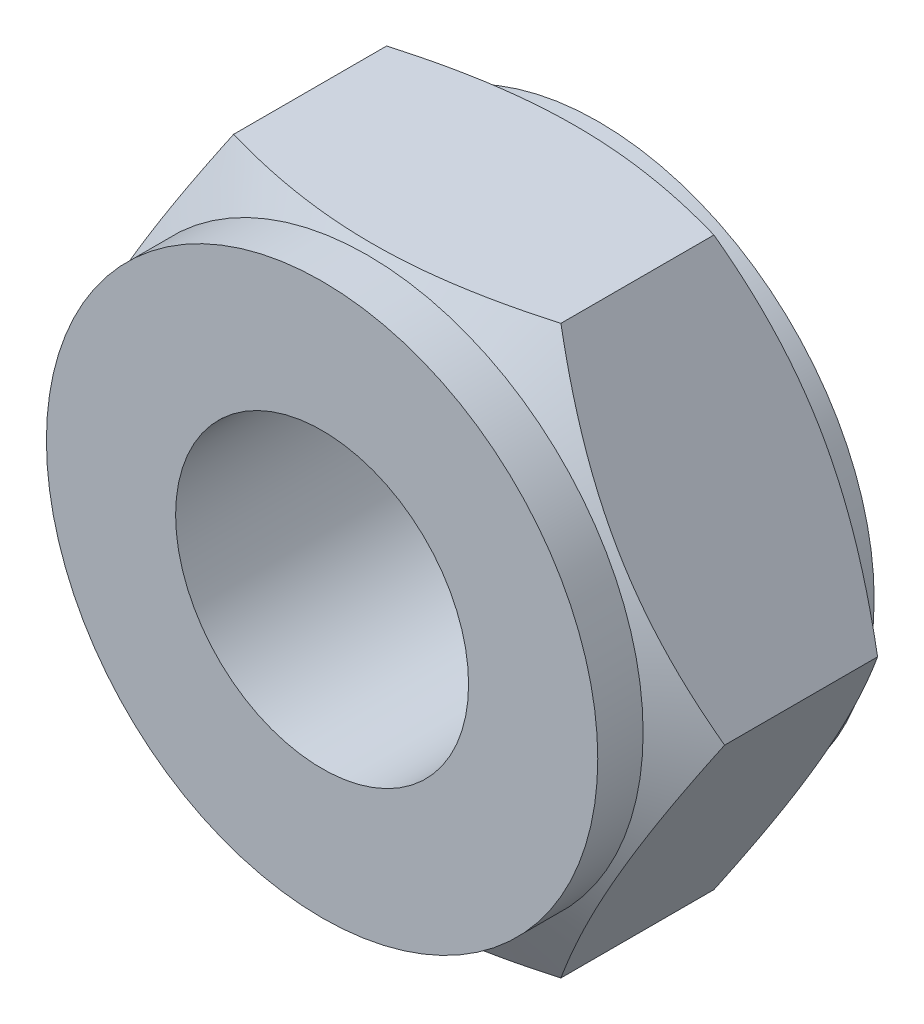
ISO-10303-21;
HEADER;
FILE_DESCRIPTION(('STEP AP214'),'2;1');
FILE_NAME('part.step','',(''),(''),'','','');
FILE_SCHEMA(('AUTOMOTIVE_DESIGN { 1 0 10303 214 1 1 1 1 }'));
ENDSEC;
DATA;
#1=APPLICATION_CONTEXT('core data for automotive mechanical design processes');
#2=APPLICATION_PROTOCOL_DEFINITION('international standard','automotive_design',2000,#1);
#3=PRODUCT_CONTEXT('',#1,'mechanical');
#4=PRODUCT('Part','Part','',(#3));
#5=PRODUCT_RELATED_PRODUCT_CATEGORY('part','',(#4));
#6=PRODUCT_DEFINITION_FORMATION('','',#4);
#7=PRODUCT_DEFINITION_CONTEXT('part definition',#1,'design');
#8=PRODUCT_DEFINITION('design','',#6,#7);
#9=PRODUCT_DEFINITION_SHAPE('','',#8);
#10=(LENGTH_UNIT() NAMED_UNIT(*) SI_UNIT(.MILLI.,.METRE.));
#11=(NAMED_UNIT(*) PLANE_ANGLE_UNIT() SI_UNIT($,.RADIAN.));
#12=(NAMED_UNIT(*) SI_UNIT($,.STERADIAN.) SOLID_ANGLE_UNIT());
#13=UNCERTAINTY_MEASURE_WITH_UNIT(LENGTH_MEASURE(1.E-05),#10,'distance_accuracy_value','');
#14=(GEOMETRIC_REPRESENTATION_CONTEXT(3) GLOBAL_UNCERTAINTY_ASSIGNED_CONTEXT((#13)) GLOBAL_UNIT_ASSIGNED_CONTEXT((#10,
#11,#12)) REPRESENTATION_CONTEXT('',''));
#15=CARTESIAN_POINT('',(0.,0.,0.));
#16=DIRECTION('',(0.,0.,1.));
#17=DIRECTION('',(1.,0.,0.));
#18=AXIS2_PLACEMENT_3D('',#15,#16,#17);
#19=CARTESIAN_POINT('',(0.,0.,3.28));
#20=DIRECTION('',(0.,0.,-1.));
#21=DIRECTION('',(-1.,0.,0.));
#22=AXIS2_PLACEMENT_3D('',#19,#20,#21);
#23=CYLINDRICAL_SURFACE('',#22,3.89);
#24=CARTESIAN_POINT('',(0.,0.,-3.52));
#25=DIRECTION('',(0.,0.,-1.));
#26=DIRECTION('',(-1.,0.,0.));
#27=AXIS2_PLACEMENT_3D('',#24,#25,#26);
#28=CIRCLE('',#27,3.89);
#29=CARTESIAN_POINT('',(-3.89,0.,-3.52));
#30=VERTEX_POINT('',#29);
#31=EDGE_CURVE('E20',#30,#30,#28,.T.);
#32=ORIENTED_EDGE('',*,*,#31,.F.);
#33=EDGE_LOOP('',(#32));
#34=FACE_BOUND('',#33,.T.);
#35=CARTESIAN_POINT('',(0.,0.,-3.26019237883202));
#36=DIRECTION('',(0.,0.,1.));
#37=DIRECTION('',(-1.,0.,0.));
#38=AXIS2_PLACEMENT_3D('',#35,#36,#37);
#39=CIRCLE('',#38,3.89000000006945);
#40=CARTESIAN_POINT('',(-3.89000000006945,0.,-3.26019237883202));
#41=VERTEX_POINT('',#40);
#42=EDGE_CURVE('E179',#41,#41,#39,.T.);
#43=ORIENTED_EDGE('',*,*,#42,.F.);
#44=EDGE_LOOP('',(#43));
#45=FACE_BOUND('',#44,.T.);
#46=ADVANCED_FACE('F17',(#34,#45),#23,.T.);
#47=CARTESIAN_POINT('',(0.,0.,-2.83689361464212));
#48=DIRECTION('',(0.,0.,1.));
#49=DIRECTION('',(1.,0.,0.));
#50=AXIS2_PLACEMENT_3D('',#47,#48,#49);
#51=CONICAL_SURFACE('',#50,4.62317496641163,1.04719755119624);
#52=CARTESIAN_POINT('',(-4.61880215351368,-5.73590683433179E-12,-2.83941825934587));
#53=CARTESIAN_POINT('',(-4.51731796242767,-0.175775775131739,-2.89802716909246));
#54=CARTESIAN_POINT('',(-4.41495776124794,-0.353068844247999,-2.95132890514521));
#55=CARTESIAN_POINT('',(-4.20846506047572,-0.710724693377609,-3.04436548454486));
#56=CARTESIAN_POINT('',(-4.10432889310188,-0.891093826174593,-3.08406741866906));
#57=CARTESIAN_POINT('',(-3.89734706567413,-1.24959686752292,-3.14586634145278));
#58=CARTESIAN_POINT('',(-3.79453324350631,-1.42767563123793,-3.16837468415098));
#59=CARTESIAN_POINT('',(-3.5884220785619,-1.78467064092886,-3.19523992308358));
#60=CARTESIAN_POINT('',(-3.4851254844293,-1.96358559021534,-3.1996190713959));
#61=CARTESIAN_POINT('',(-3.29212687968423,-2.29786897942371,-3.19048567903444));
#62=CARTESIAN_POINT('',(-3.2023959080588,-2.45328758129148,-3.1792156889114));
#63=CARTESIAN_POINT('',(-3.02351853281839,-2.76311228353242,-3.14350365790747));
#64=CARTESIAN_POINT('',(-2.93437274743071,-2.91751731310451,-3.11904942980642));
#65=CARTESIAN_POINT('',(-2.75512686792788,-3.22798028345079,-3.05791859266708));
#66=CARTESIAN_POINT('',(-2.66504944835346,-3.38399895076839,-3.02098297490716));
#67=CARTESIAN_POINT('',(-2.48623772534369,-3.69370994001023,-2.93715473766519));
#68=CARTESIAN_POINT('',(-2.39750113289062,-3.84740622662948,-2.89028180183956));
#69=CARTESIAN_POINT('',(-2.30940107675872,-3.99999999999961,-2.83941825934408));
#70=B_SPLINE_CURVE_WITH_KNOTS('',3,(#52,#53,#54,#55,#56,#57,#58,#59,#60,#61,#62,#63,#64,#65,#66,
#67,#68,#69),.UNSPECIFIED.,.F.,.F.,(4,2,2,2,2,2,2,2,4),(0.,0.634032023113349,1.26958763405349,
1.88941521230476,2.5084817777942,3.04741556526093,3.58684838758453,4.13824324497157,
4.68855594702268),.UNSPECIFIED.);
#71=CARTESIAN_POINT('',(-4.6188021534735,0.,-2.83941825937969));
#72=VERTEX_POINT('',#71);
#73=CARTESIAN_POINT('',(-2.30940107675838,-3.99999999999981,-2.83941825934408));
#74=VERTEX_POINT('',#73);
#75=EDGE_CURVE('E63',#72,#74,#70,.T.);
#76=ORIENTED_EDGE('',*,*,#75,.F.);
#77=CARTESIAN_POINT('',(-2.30940107675872,3.99999999999961,-2.83941825934408));
#78=CARTESIAN_POINT('',(-2.41088526784479,3.82422422487352,-2.89802716909082));
#79=CARTESIAN_POINT('',(-2.51324546902457,3.64693115575717,-2.95132890514373));
#80=CARTESIAN_POINT('',(-2.7197381697969,3.28927530662738,-3.0443654845437));
#81=CARTESIAN_POINT('',(-2.82387433717079,3.1089061738303,-3.08406741866806));
#82=CARTESIAN_POINT('',(-3.03085616459866,2.75040313248178,-3.14586634145211));
#83=CARTESIAN_POINT('',(-3.13366998676653,2.57232436876667,-3.16837468415047));
#84=CARTESIAN_POINT('',(-3.33978115171107,2.21532935907552,-3.19523992308339));
#85=CARTESIAN_POINT('',(-3.44307774584373,2.03641440978893,-3.19961907139588));
#86=CARTESIAN_POINT('',(-3.6360763505888,1.70213102058056,-3.19048567903468));
#87=CARTESIAN_POINT('',(-3.72580732221417,1.5467124187129,-3.17921568891178));
#88=CARTESIAN_POINT('',(-3.90468469745445,1.23688771647217,-3.14350365790813));
#89=CARTESIAN_POINT('',(-3.99383048284208,1.08248268690018,-3.11904942980722));
#90=CARTESIAN_POINT('',(-4.1730763623448,0.772019716554091,-3.05791859266816));
#91=CARTESIAN_POINT('',(-4.26315378191916,0.616001049236596,-3.02098297490839));
#92=CARTESIAN_POINT('',(-4.44196550492881,0.306290059994944,-2.9371547376667));
#93=CARTESIAN_POINT('',(-4.53070209738183,0.152593773375783,-2.89028180184121));
#94=CARTESIAN_POINT('',(-4.61880215351369,5.74348867595268E-12,-2.83941825934587));
#95=B_SPLINE_CURVE_WITH_KNOTS('',3,(#77,#78,#79,#80,#81,#82,#83,#84,#85,#86,#87,#88,#89,#90,#91,
#92,#93,#94),.UNSPECIFIED.,.F.,.F.,(4,2,2,2,2,2,2,2,4),(0.,0.63403202311376,1.26958763405432,
1.88941521230599,2.50848177779582,3.04741556526215,3.58684838758535,4.13824324497197,
4.68855594702266),.UNSPECIFIED.);
#96=CARTESIAN_POINT('',(-2.30940107675839,3.99999999999981,-2.83941825934408));
#97=VERTEX_POINT('',#96);
#98=EDGE_CURVE('E68',#97,#72,#95,.T.);
#99=ORIENTED_EDGE('',*,*,#98,.F.);
#100=CARTESIAN_POINT('',(2.30940107675805,4.,-2.83941825934408));
#101=CARTESIAN_POINT('',(2.10643269458592,4.,-2.89802716909082));
#102=CARTESIAN_POINT('',(1.90171229222636,4.,-2.95132890514373));
#103=CARTESIAN_POINT('',(1.48872689068169,4.,-3.0443654845437));
#104=CARTESIAN_POINT('',(1.2804545559339,4.,-3.08406741866807));
#105=CARTESIAN_POINT('',(0.866490901078168,4.,-3.14586634145211));
#106=CARTESIAN_POINT('',(0.660863256742426,4.,-3.16837468415047));
#107=CARTESIAN_POINT('',(0.248640926853356,4.,-3.19523992308339));
#108=CARTESIAN_POINT('',(0.0420477385880334,4.,-3.19961907139587));
#109=CARTESIAN_POINT('',(-0.343949470902628,4.,-3.19048567903466));
#110=CARTESIAN_POINT('',(-0.523411414153886,4.,-3.17921568891171));
#111=CARTESIAN_POINT('',(-0.881166164635488,4.,-3.14350365790788));
#112=CARTESIAN_POINT('',(-1.05945773541124,4.,-3.11904942980684));
#113=CARTESIAN_POINT('',(-1.41794949441772,4.,-3.05791859266747));
#114=CARTESIAN_POINT('',(-1.59810433356697,4.,-3.02098297490751));
#115=CARTESIAN_POINT('',(-1.95572777958731,4.,-2.93715473766539));
#116=CARTESIAN_POINT('',(-2.13320096449385,4.,-2.89028180183967));
#117=CARTESIAN_POINT('',(-2.30940107675805,4.,-2.83941825934408));
#118=B_SPLINE_CURVE_WITH_KNOTS('',3,(#100,#101,#102,#103,#104,#105,#106,#107,#108,#109,#110,
#111,#112,#113,#114,#115,#116,#117),.UNSPECIFIED.,.F.,.F.,(4,2,2,2,2,2,2,2,4),(0.,
0.634032023113766,1.26958763405433,1.88941521230599,2.50848177779582,3.04741556526371,
3.58684838758848,4.13824324497675,4.68855594702908),.UNSPECIFIED.);
#119=CARTESIAN_POINT('',(2.30940107675839,3.99999999999981,-2.83941825934408));
#120=VERTEX_POINT('',#119);
#121=EDGE_CURVE('E80',#120,#97,#118,.T.);
#122=ORIENTED_EDGE('',*,*,#121,.F.);
#123=CARTESIAN_POINT('',(4.61880215351369,5.73604323312061E-12,-2.83941825934586));
#124=CARTESIAN_POINT('',(4.51731796242768,0.17577577513174,-2.89802716909245));
#125=CARTESIAN_POINT('',(4.41495776124795,0.353068844248001,-2.95132890514521));
#126=CARTESIAN_POINT('',(4.20846506047573,0.710724693377611,-3.04436548454486));
#127=CARTESIAN_POINT('',(4.10432889310189,0.891093826174595,-3.08406741866906));
#128=CARTESIAN_POINT('',(3.89734706567413,1.24959686752292,-3.14586634145277));
#129=CARTESIAN_POINT('',(3.79453324350632,1.42767563123793,-3.16837468415097));
#130=CARTESIAN_POINT('',(3.5884220785619,1.78467064092887,-3.19523992308357));
#131=CARTESIAN_POINT('',(3.4851254844293,1.96358559021535,-3.1996190713959));
#132=CARTESIAN_POINT('',(3.29212687968424,2.29786897942371,-3.19048567903443));
#133=CARTESIAN_POINT('',(3.2023959080588,2.45328758129148,-3.1792156889114));
#134=CARTESIAN_POINT('',(3.0235185328184,2.76311228353242,-3.14350365790747));
#135=CARTESIAN_POINT('',(2.93437274743072,2.91751731310451,-3.11904942980641));
#136=CARTESIAN_POINT('',(2.75512686792788,3.2279802834508,-3.05791859266707));
#137=CARTESIAN_POINT('',(2.66504944835347,3.38399895076839,-3.02098297490715));
#138=CARTESIAN_POINT('',(2.4862377253437,3.69370994001023,-2.93715473766518));
#139=CARTESIAN_POINT('',(2.39750113289063,3.84740622662948,-2.89028180183956));
#140=CARTESIAN_POINT('',(2.30940107675873,3.99999999999961,-2.83941825934408));
#141=B_SPLINE_CURVE_WITH_KNOTS('',3,(#123,#124,#125,#126,#127,#128,#129,#130,#131,#132,#133,
#134,#135,#136,#137,#138,#139,#140),.UNSPECIFIED.,.F.,.F.,(4,2,2,2,2,2,2,2,4),(0.,
0.63403202311335,1.26958763405349,1.88941521230476,2.50848177779421,3.04741556526093,
3.58684838758453,4.13824324497157,4.68855594702267),.UNSPECIFIED.);
#142=CARTESIAN_POINT('',(4.61880215348771,0.,-2.83941825935585));
#143=VERTEX_POINT('',#142);
#144=EDGE_CURVE('E188',#143,#120,#141,.T.);
#145=ORIENTED_EDGE('',*,*,#144,.F.);
#146=CARTESIAN_POINT('',(2.30940107675874,-3.99999999999961,-2.83941825934408));
#147=CARTESIAN_POINT('',(2.4108852678448,-3.82422422487352,-2.89802716909081));
#148=CARTESIAN_POINT('',(2.51324546902458,-3.64693115575717,-2.95132890514372));
#149=CARTESIAN_POINT('',(2.71973816979691,-3.28927530662738,-3.04436548454369));
#150=CARTESIAN_POINT('',(2.82387433717081,-3.1089061738303,-3.08406741866806));
#151=CARTESIAN_POINT('',(3.03085616459868,-2.75040313248177,-3.1458663414521));
#152=CARTESIAN_POINT('',(3.13366998676655,-2.57232436876667,-3.16837468415047));
#153=CARTESIAN_POINT('',(3.33978115171109,-2.21532935907552,-3.19523992308339));
#154=CARTESIAN_POINT('',(3.44307774584375,-2.03641440978893,-3.19961907139587));
#155=CARTESIAN_POINT('',(3.63607635058882,-1.70213102058056,-3.19048567903467));
#156=CARTESIAN_POINT('',(3.72580732221419,-1.5467124187129,-3.17921568891177));
#157=CARTESIAN_POINT('',(3.90468469745447,-1.23688771647216,-3.14350365790812));
#158=CARTESIAN_POINT('',(3.99383048284209,-1.08248268690017,-3.11904942980721));
#159=CARTESIAN_POINT('',(4.17307636234482,-0.772019716554091,-3.05791859266815));
#160=CARTESIAN_POINT('',(4.26315378191918,-0.616001049236597,-3.02098297490838));
#161=CARTESIAN_POINT('',(4.44196550492883,-0.306290059994946,-2.93715473766669));
#162=CARTESIAN_POINT('',(4.53070209738185,-0.152593773375787,-2.8902818018412));
#163=CARTESIAN_POINT('',(4.6188021535137,-5.74804397884381E-12,-2.83941825934586));
#164=B_SPLINE_CURVE_WITH_KNOTS('',3,(#146,#147,#148,#149,#150,#151,#152,#153,#154,#155,#156,
#157,#158,#159,#160,#161,#162,#163),.UNSPECIFIED.,.F.,.F.,(4,2,2,2,2,2,2,2,4),(0.,
0.634032023113761,1.26958763405432,1.88941521230599,2.50848177779583,3.04741556526215,
3.58684838758535,4.13824324497196,4.68855594702265),.UNSPECIFIED.);
#165=CARTESIAN_POINT('',(2.3094010767584,-3.9999999999998,-2.83941825934408));
#166=VERTEX_POINT('',#165);
#167=EDGE_CURVE('E111',#166,#143,#164,.T.);
#168=ORIENTED_EDGE('',*,*,#167,.F.);
#169=CARTESIAN_POINT('',(-2.30940107675804,-4.,-2.83941825934408));
#170=CARTESIAN_POINT('',(-2.10643269458591,-4.,-2.89802716909082));
#171=CARTESIAN_POINT('',(-1.90171229222635,-4.,-2.95132890514373));
#172=CARTESIAN_POINT('',(-1.48872689068169,-4.,-3.0443654845437));
#173=CARTESIAN_POINT('',(-1.2804545559339,-4.,-3.08406741866807));
#174=CARTESIAN_POINT('',(-0.866490901078162,-4.,-3.14586634145211));
#175=CARTESIAN_POINT('',(-0.66086325674242,-4.,-3.16837468415047));
#176=CARTESIAN_POINT('',(-0.24864092685335,-4.,-3.19523992308339));
#177=CARTESIAN_POINT('',(-0.0420477385880274,-4.,-3.19961907139588));
#178=CARTESIAN_POINT('',(0.343949470902635,-4.,-3.19048567903466));
#179=CARTESIAN_POINT('',(0.523411414153894,-4.,-3.17921568891171));
#180=CARTESIAN_POINT('',(0.881166164635497,-4.,-3.14350365790788));
#181=CARTESIAN_POINT('',(1.05945773541125,-4.,-3.11904942980684));
#182=CARTESIAN_POINT('',(1.41794949441773,-4.,-3.05791859266747));
#183=CARTESIAN_POINT('',(1.59810433356698,-4.,-3.02098297490751));
#184=CARTESIAN_POINT('',(1.95572777958732,-4.,-2.93715473766539));
#185=CARTESIAN_POINT('',(2.13320096449386,-4.,-2.89028180183967));
#186=CARTESIAN_POINT('',(2.30940107675806,-4.,-2.83941825934408));
#187=B_SPLINE_CURVE_WITH_KNOTS('',3,(#169,#170,#171,#172,#173,#174,#175,#176,#177,#178,#179,
#180,#181,#182,#183,#184,#185,#186),.UNSPECIFIED.,.F.,.F.,(4,2,2,2,2,2,2,2,4),(0.,
0.634032023113765,1.26958763405433,1.88941521230599,2.50848177779582,3.04741556526371,
3.58684838758848,4.13824324497675,4.68855594702909),.UNSPECIFIED.);
#188=EDGE_CURVE('E71',#74,#166,#187,.T.);
#189=ORIENTED_EDGE('',*,*,#188,.F.);
#190=EDGE_LOOP('',(#76,#99,#122,#145,#168,#189));
#191=FACE_BOUND('',#190,.T.);
#192=ORIENTED_EDGE('',*,*,#42,.T.);
#193=EDGE_LOOP('',(#192));
#194=FACE_BOUND('',#193,.T.);
#195=ADVANCED_FACE('F64',(#191,#194),#51,.T.);
#196=CARTESIAN_POINT('',(-2.30940107675849,-4.,-3.52));
#197=DIRECTION('',(0.,0.,-1.));
#198=DIRECTION('',(-1.,0.,0.));
#199=AXIS2_PLACEMENT_3D('',#196,#197,#198);
#200=PLANE('',#199);
#201=CARTESIAN_POINT('',(0.,0.,-3.52000000004606));
#202=DIRECTION('',(0.,0.,-1.));
#203=DIRECTION('',(-1.,0.,0.));
#204=AXIS2_PLACEMENT_3D('',#201,#202,#203);
#205=CIRCLE('',#204,2.87500000001728);
#206=CARTESIAN_POINT('',(-2.87500000001728,0.,-3.52000000004606));
#207=VERTEX_POINT('',#206);
#208=EDGE_CURVE('E83',#207,#207,#205,.F.);
#209=ORIENTED_EDGE('',*,*,#208,.T.);
#210=EDGE_LOOP('',(#209));
#211=FACE_BOUND('',#210,.T.);
#212=ORIENTED_EDGE('',*,*,#31,.T.);
#213=EDGE_LOOP('',(#212));
#214=FACE_BOUND('',#213,.T.);
#215=ADVANCED_FACE('F104',(#211,#214),#200,.T.);
#216=CARTESIAN_POINT('',(-4.618802153517,0.,-3.52));
#217=DIRECTION('',(-0.866025403784439,-0.5,0.));
#218=DIRECTION('',(0.5,-0.866025403784439,0.));
#219=AXIS2_PLACEMENT_3D('',#216,#217,#218);
#220=PLANE('',#219);
#221=DIRECTION('',(0.,0.,1.));
#222=VECTOR('',#221,1.);
#223=CARTESIAN_POINT('',(-4.618802153517,0.,-3.52));
#224=LINE('',#223,#222);
#225=CARTESIAN_POINT('',(-4.61880215351613,0.,-0.680581740657889));
#226=VERTEX_POINT('',#225);
#227=EDGE_CURVE('E74',#72,#226,#224,.T.);
#228=ORIENTED_EDGE('',*,*,#227,.F.);
#229=ORIENTED_EDGE('',*,*,#75,.T.);
#230=DIRECTION('',(0.,0.,1.));
#231=VECTOR('',#230,1.);
#232=CARTESIAN_POINT('',(-2.30940107675849,-4.,-3.52));
#233=LINE('',#232,#231);
#234=CARTESIAN_POINT('',(-2.30940109340961,-4.,-0.680581745467265));
#235=VERTEX_POINT('',#234);
#236=EDGE_CURVE('E73',#235,#74,#233,.F.);
#237=ORIENTED_EDGE('',*,*,#236,.F.);
#238=CARTESIAN_POINT('',(-4.61880215351596,-1.80305391824773E-12,-0.680581740659897));
#239=CARTESIAN_POINT('',(-4.51731796244398,-0.175775775103493,-0.621972830921223));
#240=CARTESIAN_POINT('',(-4.41495776127846,-0.353068844195138,-0.568671094875031));
#241=CARTESIAN_POINT('',(-4.20846506053689,-0.710724693271661,-0.475634515485113));
#242=CARTESIAN_POINT('',(-4.10432889317952,-0.891093826040126,-0.435932581363831));
#243=CARTESIAN_POINT('',(-3.89734706575416,-1.24959686738429,-0.374133658570449));
#244=CARTESIAN_POINT('',(-3.7945332435719,-1.42767563112431,-0.351625315864611));
#245=CARTESIAN_POINT('',(-3.58842207859598,-1.78467064086982,-0.324760076922744));
#246=CARTESIAN_POINT('',(-3.48512548444632,-1.96358559018586,-0.320380928609024));
#247=CARTESIAN_POINT('',(-3.29212688334392,-2.29786897308494,-0.329514320795707));
#248=CARTESIAN_POINT('',(-3.20239591537037,-2.45328756862745,-0.340784310171359));
#249=CARTESIAN_POINT('',(-3.02351854737306,-2.763112258323,-0.376496338652439));
#250=CARTESIAN_POINT('',(-2.93437276557644,-2.9175172816752,-0.400950564975588));
#251=CARTESIAN_POINT('',(-2.75512689333883,-3.22798023943772,-0.462081397681879));
#252=CARTESIAN_POINT('',(-2.66504947743503,-3.38399890039763,-0.49901701275454));
#253=CARTESIAN_POINT('',(-2.48623776163293,-3.69370987715542,-0.582845244037596));
#254=CARTESIAN_POINT('',(-2.3975011727174,-3.84740615764747,-0.629718176595119));
#255=CARTESIAN_POINT('',(-2.30940112007343,-3.99999992497632,-0.680581715652609));
#256=B_SPLINE_CURVE_WITH_KNOTS('',3,(#238,#239,#240,#241,#242,#243,#244,#245,#246,#247,#248,
#249,#250,#251,#252,#253,#254,#255),.UNSPECIFIED.,.F.,.F.,(4,2,2,2,2,2,2,2,4),(0.,
0.634032023026007,1.26958763386756,1.88941521220828,2.50848177779535,3.04741554331967,
3.58684834361968,4.13824317783946,4.68855585689971),.UNSPECIFIED.);
#257=EDGE_CURVE('E35',#226,#235,#256,.T.);
#258=ORIENTED_EDGE('',*,*,#257,.F.);
#259=EDGE_LOOP('',(#228,#229,#237,#258));
#260=FACE_BOUND('',#259,.T.);
#261=ADVANCED_FACE('F75',(#260),#220,.T.);
#262=CARTESIAN_POINT('',(-2.30940107675849,-4.,-3.52));
#263=DIRECTION('',(0.,-1.,0.));
#264=DIRECTION('',(1.,0.,0.));
#265=AXIS2_PLACEMENT_3D('',#262,#263,#264);
#266=PLANE('',#265);
#267=ORIENTED_EDGE('',*,*,#236,.T.);
#268=ORIENTED_EDGE('',*,*,#188,.T.);
#269=DIRECTION('',(0.,0.,1.));
#270=VECTOR('',#269,1.);
#271=CARTESIAN_POINT('',(2.30940107675852,-4.,-3.52));
#272=LINE('',#271,#270);
#273=CARTESIAN_POINT('',(2.30940106843087,-4.00000001442391,-0.680581745468477));
#274=VERTEX_POINT('',#273);
#275=EDGE_CURVE('E125',#274,#166,#272,.F.);
#276=ORIENTED_EDGE('',*,*,#275,.F.);
#277=CARTESIAN_POINT('',(-2.30940110351642,-3.99999996248763,-0.680581772944216));
#278=CARTESIAN_POINT('',(-2.10643272249927,-3.99999998652724,-0.621972847174614));
#279=CARTESIAN_POINT('',(-1.90171231902133,-3.99999999638907,-0.568671103799689));
#280=CARTESIAN_POINT('',(-1.48872691340506,-4.0000000036196,-0.475634517672028));
#281=CARTESIAN_POINT('',(-1.28045457570248,-4.00000000095822,-0.43593258414569));
#282=CARTESIAN_POINT('',(-0.866490915803741,-3.99999999906549,-0.374133660889823));
#283=CARTESIAN_POINT('',(-0.660863269373307,-3.99999999975089,-0.351625317135899));
#284=CARTESIAN_POINT('',(-0.248640935005505,-4.0000000002488,-0.324760076994751));
#285=CARTESIAN_POINT('',(-0.042047744355798,-4.00000000006239,-0.320380928537159));
#286=CARTESIAN_POINT('',(0.343949460368308,-3.99999999994568,-0.329514320663676));
#287=CARTESIAN_POINT('',(0.523411396493218,-3.99999999998536,-0.340784309946792));
#288=CARTESIAN_POINT('',(0.881166132795949,-4.00000000001465,-0.376496338300437));
#289=CARTESIAN_POINT('',(1.05945769651991,-4.00000000000422,-0.400950564584484));
#290=CARTESIAN_POINT('',(1.41794944151398,-3.99999999999568,-0.462081397272556));
#291=CARTESIAN_POINT('',(1.59810427370667,-3.99999999999784,-0.499017012383614));
#292=CARTESIAN_POINT('',(1.95572770615214,-4.00000000000215,-0.582845243809378));
#293=CARTESIAN_POINT('',(2.13320088443837,-4.0000000000043,-0.629718176475666));
#294=CARTESIAN_POINT('',(2.30940099017536,-4.,-0.680581715666101));
#295=B_SPLINE_CURVE_WITH_KNOTS('',3,(#277,#278,#279,#280,#281,#282,#283,#284,#285,#286,#287,
#288,#289,#290,#291,#292,#293,#294),.UNSPECIFIED.,.F.,.F.,(4,2,2,2,2,2,2,2,4),(0.,
0.634032031834983,1.26958765081319,1.88941523582196,2.50848180835725,3.0474155744189,
3.58684837508235,4.13824321045645,4.68855589091895),.UNSPECIFIED.);
#296=EDGE_CURVE('E136',#235,#274,#295,.T.);
#297=ORIENTED_EDGE('',*,*,#296,.F.);
#298=EDGE_LOOP('',(#267,#268,#276,#297));
#299=FACE_BOUND('',#298,.T.);
#300=ADVANCED_FACE('F126',(#299),#266,.T.);
#301=CARTESIAN_POINT('',(2.30940107675852,-4.,-3.52));
#302=DIRECTION('',(0.866025403784439,-0.5,0.));
#303=DIRECTION('',(0.5,0.866025403784439,0.));
#304=AXIS2_PLACEMENT_3D('',#301,#302,#303);
#305=PLANE('',#304);
#306=ORIENTED_EDGE('',*,*,#275,.T.);
#307=ORIENTED_EDGE('',*,*,#167,.T.);
#308=DIRECTION('',(0.,0.,1.));
#309=VECTOR('',#308,1.);
#310=CARTESIAN_POINT('',(4.61880215351701,0.,-3.52));
#311=LINE('',#310,#309);
#312=CARTESIAN_POINT('',(4.61880215351597,0.,-0.680581740659905));
#313=VERTEX_POINT('',#312);
#314=EDGE_CURVE('E185',#313,#143,#311,.F.);
#315=ORIENTED_EDGE('',*,*,#314,.F.);
#316=CARTESIAN_POINT('',(2.30940103090809,-4.00000000444028,-0.680581772931595));
#317=CARTESIAN_POINT('',(2.41088524223646,-3.82422424230081,-0.621972847163885));
#318=CARTESIAN_POINT('',(2.51324545252448,-3.64693117711912,-0.568671103786385));
#319=CARTESIAN_POINT('',(2.71973816162016,-3.28927532802434,-0.475634517651644));
#320=CARTESIAN_POINT('',(2.82387432818394,-3.10890619131118,-0.435932584121048));
#321=CARTESIAN_POINT('',(3.03085615649661,-2.75040314464718,-0.374133660873277));
#322=CARTESIAN_POINT('',(3.1336699802902,-2.57232437948613,-0.35162531712675));
#323=CARTESIAN_POINT('',(3.33978114787275,-2.21532936622099,-0.324760076993857));
#324=CARTESIAN_POINT('',(3.44307774301879,-2.0364144148066,-0.320380928536883));
#325=CARTESIAN_POINT('',(3.63607634892112,-1.70213102336053,-0.329514320836684));
#326=CARTESIAN_POINT('',(3.72580732066883,-1.54671242136028,-0.340784310866357));
#327=CARTESIAN_POINT('',(3.90468469608674,-1.23688771887043,-0.376496341740967));
#328=CARTESIAN_POINT('',(3.99383048152983,-1.08248268918152,-0.400950569801861));
#329=CARTESIAN_POINT('',(4.17307636128278,-0.772019718384964,-0.462081406920684));
#330=CARTESIAN_POINT('',(4.2631537810506,-0.616001050736709,-0.499017024717738));
#331=CARTESIAN_POINT('',(4.44196550448273,-0.306290060771917,-0.582845262099807));
#332=CARTESIAN_POINT('',(4.53070209716425,-0.152593773761278,-0.629718198032846));
#333=CARTESIAN_POINT('',(4.61880215351597,-1.81536132999244E-12,-0.680581740659906));
#334=B_SPLINE_CURVE_WITH_KNOTS('',3,(#316,#317,#318,#319,#320,#321,#322,#323,#324,#325,#326,
#327,#328,#329,#330,#331,#332,#333),.UNSPECIFIED.,.F.,.F.,(4,2,2,2,2,2,2,2,4),(0.,
0.634032031918795,1.26958765099256,1.88941523590971,2.508481808345,3.04741559634307,
3.58684841902422,4.13824327755889,4.68855598100544),.UNSPECIFIED.);
#335=EDGE_CURVE('E143',#274,#313,#334,.T.);
#336=ORIENTED_EDGE('',*,*,#335,.F.);
#337=EDGE_LOOP('',(#306,#307,#315,#336));
#338=FACE_BOUND('',#337,.T.);
#339=ADVANCED_FACE('F129',(#338),#305,.T.);
#340=CARTESIAN_POINT('',(4.61880215351701,0.,-3.52));
#341=DIRECTION('',(0.866025403784439,0.5,0.));
#342=DIRECTION('',(-0.5,0.866025403784439,0.));
#343=AXIS2_PLACEMENT_3D('',#340,#341,#342);
#344=PLANE('',#343);
#345=ORIENTED_EDGE('',*,*,#314,.T.);
#346=ORIENTED_EDGE('',*,*,#144,.T.);
#347=DIRECTION('',(0.,0.,1.));
#348=VECTOR('',#347,1.);
#349=CARTESIAN_POINT('',(2.3094010767585,4.,-3.52));
#350=LINE('',#349,#348);
#351=CARTESIAN_POINT('',(2.30940109340859,4.,-0.680581745466972));
#352=VERTEX_POINT('',#351);
#353=EDGE_CURVE('E189',#352,#120,#350,.F.);
#354=ORIENTED_EDGE('',*,*,#353,.F.);
#355=CARTESIAN_POINT('',(4.61880215351596,1.80430192027607E-12,-0.680581740659903));
#356=CARTESIAN_POINT('',(4.51731796244399,0.175775775103495,-0.621972830921228));
#357=CARTESIAN_POINT('',(4.41495776127847,0.353068844195141,-0.568671094875036));
#358=CARTESIAN_POINT('',(4.20846506053689,0.710724693271667,-0.475634515485118));
#359=CARTESIAN_POINT('',(4.10432889317952,0.891093826040132,-0.435932581363836));
#360=CARTESIAN_POINT('',(3.89734706575417,1.24959686738429,-0.374133658570454));
#361=CARTESIAN_POINT('',(3.79453324357191,1.42767563112432,-0.351625315864617));
#362=CARTESIAN_POINT('',(3.58842207859599,1.78467064086982,-0.324760076922749));
#363=CARTESIAN_POINT('',(3.48512548444633,1.96358559018586,-0.320380928609029));
#364=CARTESIAN_POINT('',(3.29212688334384,2.29786897308508,-0.329514320795716));
#365=CARTESIAN_POINT('',(3.20239591537022,2.45328756862774,-0.340784310171385));
#366=CARTESIAN_POINT('',(3.02351854737274,2.76311225832357,-0.376496338652522));
#367=CARTESIAN_POINT('',(2.93437276557603,2.91751728167591,-0.40095056497571));
#368=CARTESIAN_POINT('',(2.75512689333827,3.22798023943872,-0.4620813976821));
#369=CARTESIAN_POINT('',(2.66504947743438,3.38399890039877,-0.499017012754822));
#370=CARTESIAN_POINT('',(2.48623776163213,3.69370987715684,-0.582845244038013));
#371=CARTESIAN_POINT('',(2.39750117271652,3.84740615764903,-0.62971817659561));
#372=CARTESIAN_POINT('',(2.30940112007247,3.99999992497801,-0.680581715653176));
#373=B_SPLINE_CURVE_WITH_KNOTS('',3,(#355,#356,#357,#358,#359,#360,#361,#362,#363,#364,#365,
#366,#367,#368,#369,#370,#371,#372),.UNSPECIFIED.,.F.,.F.,(4,2,2,2,2,2,2,2,4),(0.,
0.63403202302601,1.26958763386756,1.88941521220829,2.50848177779535,3.04741554332016,
3.58684834362067,4.13824317784097,4.68855585690174),.UNSPECIFIED.);
#374=EDGE_CURVE('E332',#313,#352,#373,.T.);
#375=ORIENTED_EDGE('',*,*,#374,.F.);
#376=EDGE_LOOP('',(#345,#346,#354,#375));
#377=FACE_BOUND('',#376,.T.);
#378=ADVANCED_FACE('F256',(#377),#344,.T.);
#379=CARTESIAN_POINT('',(2.3094010767585,4.,-3.52));
#380=DIRECTION('',(0.,1.,0.));
#381=DIRECTION('',(-1.,0.,0.));
#382=AXIS2_PLACEMENT_3D('',#379,#380,#381);
#383=PLANE('',#382);
#384=ORIENTED_EDGE('',*,*,#353,.T.);
#385=ORIENTED_EDGE('',*,*,#121,.T.);
#386=DIRECTION('',(0.,0.,1.));
#387=VECTOR('',#386,1.);
#388=CARTESIAN_POINT('',(-2.3094010767585,4.,-3.52));
#389=LINE('',#388,#387);
#390=CARTESIAN_POINT('',(-2.30940106843097,4.0000000144237,-0.680581745468403));
#391=VERTEX_POINT('',#390);
#392=EDGE_CURVE('E79',#391,#97,#389,.F.);
#393=ORIENTED_EDGE('',*,*,#392,.F.);
#394=CARTESIAN_POINT('',(2.30940110351448,3.99999996248827,-0.680581772943237));
#395=CARTESIAN_POINT('',(2.10643272249734,3.99999998652747,-0.621972847173943));
#396=CARTESIAN_POINT('',(1.90171231901945,3.99999999638914,-0.568671103799182));
#397=CARTESIAN_POINT('',(1.4887269134033,4.00000000361954,-0.475634517671714));
#398=CARTESIAN_POINT('',(1.28045457570079,4.00000000095821,-0.435932584145406));
#399=CARTESIAN_POINT('',(0.866490915802194,3.99999999906551,-0.374133660889626));
#400=CARTESIAN_POINT('',(0.660863269371822,3.9999999997509,-0.351625317135759));
#401=CARTESIAN_POINT('',(0.248640935004154,4.0000000002488,-0.324760076994709));
#402=CARTESIAN_POINT('',(0.0420477443545168,4.00000000006239,-0.320380928537156));
#403=CARTESIAN_POINT('',(-0.34394946036946,3.99999999994569,-0.329514320663737));
#404=CARTESIAN_POINT('',(-0.523411396494312,3.99999999998536,-0.340784309946878));
#405=CARTESIAN_POINT('',(-0.881166132796926,4.00000000001466,-0.376496338300563));
#406=CARTESIAN_POINT('',(-1.05945769652083,4.00000000000423,-0.400950564584625));
#407=CARTESIAN_POINT('',(-1.41794944151477,3.99999999999568,-0.462081397272715));
#408=CARTESIAN_POINT('',(-1.5981042737074,3.99999999999785,-0.499017012383775));
#409=CARTESIAN_POINT('',(-1.95572770615274,4.00000000000216,-0.582845243809535));
#410=CARTESIAN_POINT('',(-2.1332008844389,4.00000000000431,-0.629718176475817));
#411=CARTESIAN_POINT('',(-2.30940099017583,4.,-0.680581715666241));
#412=B_SPLINE_CURVE_WITH_KNOTS('',3,(#394,#395,#396,#397,#398,#399,#400,#401,#402,#403,#404,
#405,#406,#407,#408,#409,#410,#411),.UNSPECIFIED.,.F.,.F.,(4,2,2,2,2,2,2,2,4),(0.,
0.634032031834733,1.2695876508127,1.88941523582127,2.50848180835634,3.04741557441782,
3.5868483750811,4.13824321045501,4.68855589091732),.UNSPECIFIED.);
#413=EDGE_CURVE('E162',#352,#391,#412,.T.);
#414=ORIENTED_EDGE('',*,*,#413,.F.);
#415=EDGE_LOOP('',(#384,#385,#393,#414));
#416=FACE_BOUND('',#415,.T.);
#417=ADVANCED_FACE('F219',(#416),#383,.T.);
#418=CARTESIAN_POINT('',(-2.3094010767585,4.,-3.52));
#419=DIRECTION('',(-0.866025403784439,0.5,0.));
#420=DIRECTION('',(-0.5,-0.866025403784439,0.));
#421=AXIS2_PLACEMENT_3D('',#418,#419,#420);
#422=PLANE('',#421);
#423=ORIENTED_EDGE('',*,*,#392,.T.);
#424=ORIENTED_EDGE('',*,*,#98,.T.);
#425=ORIENTED_EDGE('',*,*,#227,.T.);
#426=CARTESIAN_POINT('',(-2.30940103090844,4.00000000443996,-0.68058177293136));
#427=CARTESIAN_POINT('',(-2.41088524223672,3.82422424230045,-0.621972847163723));
#428=CARTESIAN_POINT('',(-2.5132454525247,3.64693117711875,-0.568671103786262));
#429=CARTESIAN_POINT('',(-2.71973816162034,3.28927532802397,-0.475634517651565));
#430=CARTESIAN_POINT('',(-2.82387432818412,3.10890619131083,-0.435932584120975));
#431=CARTESIAN_POINT('',(-3.03085615649678,2.75040314464687,-0.374133660873224));
#432=CARTESIAN_POINT('',(-3.13366998029036,2.57232437948584,-0.35162531712671));
#433=CARTESIAN_POINT('',(-3.33978114787289,2.21532936622072,-0.32476007699384));
#434=CARTESIAN_POINT('',(-3.44307774301892,2.03641441480634,-0.320380928536874));
#435=CARTESIAN_POINT('',(-3.63607634892124,1.70213102336031,-0.329514320836689));
#436=CARTESIAN_POINT('',(-3.72580732066893,1.54671242136008,-0.340784310866367));
#437=CARTESIAN_POINT('',(-3.90468469608682,1.23688771887027,-0.376496341740983));
#438=CARTESIAN_POINT('',(-3.9938304815299,1.08248268918137,-0.400950569801878));
#439=CARTESIAN_POINT('',(-4.17307636128282,0.772019718384856,-0.462081406920701));
#440=CARTESIAN_POINT('',(-4.26315378105063,0.616001050736621,-0.499017024717752));
#441=CARTESIAN_POINT('',(-4.44196550448274,0.306290060771869,-0.582845262099813));
#442=CARTESIAN_POINT('',(-4.53070209716425,0.152593773761249,-0.629718198032846));
#443=CARTESIAN_POINT('',(-4.61880215351596,1.80617967026798E-12,-0.6805817406599));
#444=B_SPLINE_CURVE_WITH_KNOTS('',3,(#426,#427,#428,#429,#430,#431,#432,#433,#434,#435,#436,
#437,#438,#439,#440,#441,#442,#443),.UNSPECIFIED.,.F.,.F.,(4,2,2,2,2,2,2,2,4),(0.,
0.634032031918734,1.26958765099245,1.88941523590954,2.50848180834478,3.04741559634279,
3.58684841902387,4.13824327755847,4.68855598100495),.UNSPECIFIED.);
#445=EDGE_CURVE('E170',#391,#226,#444,.T.);
#446=ORIENTED_EDGE('',*,*,#445,.F.);
#447=EDGE_LOOP('',(#423,#424,#425,#446));
#448=FACE_BOUND('',#447,.T.);
#449=ADVANCED_FACE('F82',(#448),#422,.T.);
#450=CARTESIAN_POINT('',(0.,0.,-3.51999999998043));
#451=DIRECTION('',(0.,0.,-1.));
#452=DIRECTION('',(-1.,0.,0.));
#453=AXIS2_PLACEMENT_3D('',#450,#451,#452);
#454=CONICAL_SURFACE('',#453,2.87499999990359,1.04719755119535);
#455=ORIENTED_EDGE('',*,*,#208,.F.);
#456=EDGE_LOOP('',(#455));
#457=FACE_BOUND('',#456,.T.);
#458=CARTESIAN_POINT('',(0.,0.,-3.05350098249479));
#459=DIRECTION('',(0.,0.,1.));
#460=DIRECTION('',(1.,0.,0.));
#461=AXIS2_PLACEMENT_3D('',#458,#459,#460);
#462=CIRCLE('',#461,2.067);
#463=CARTESIAN_POINT('',(2.067,0.,-3.05350098249479));
#464=VERTEX_POINT('',#463);
#465=EDGE_CURVE('E175',#464,#464,#462,.T.);
#466=ORIENTED_EDGE('',*,*,#465,.T.);
#467=EDGE_LOOP('',(#466));
#468=FACE_BOUND('',#467,.T.);
#469=ADVANCED_FACE('F156',(#457,#468),#454,.F.);
#470=CARTESIAN_POINT('',(0.,0.,-0.683106385395149));
#471=DIRECTION('',(0.,0.,-1.));
#472=DIRECTION('',(-1.,0.,0.));
#473=AXIS2_PLACEMENT_3D('',#470,#471,#472);
#474=CONICAL_SURFACE('',#473,4.62317496646847,1.04719755119624);
#475=ORIENTED_EDGE('',*,*,#335,.T.);
#476=ORIENTED_EDGE('',*,*,#374,.T.);
#477=ORIENTED_EDGE('',*,*,#413,.T.);
#478=ORIENTED_EDGE('',*,*,#445,.T.);
#479=ORIENTED_EDGE('',*,*,#257,.T.);
#480=ORIENTED_EDGE('',*,*,#296,.T.);
#481=EDGE_LOOP('',(#475,#476,#477,#478,#479,#480));
#482=FACE_BOUND('',#481,.T.);
#483=CARTESIAN_POINT('',(0.,0.,-0.259807621135334));
#484=DIRECTION('',(0.,0.,-1.));
#485=DIRECTION('',(-1.,0.,0.));
#486=AXIS2_PLACEMENT_3D('',#483,#484,#485);
#487=CIRCLE('',#486,3.89);
#488=CARTESIAN_POINT('',(-3.89,0.,-0.259807621135334));
#489=VERTEX_POINT('',#488);
#490=EDGE_CURVE('E177',#489,#489,#487,.F.);
#491=ORIENTED_EDGE('',*,*,#490,.F.);
#492=EDGE_LOOP('',(#491));
#493=FACE_BOUND('',#492,.T.);
#494=ADVANCED_FACE('F151',(#482,#493),#474,.T.);
#495=CARTESIAN_POINT('',(0.,0.,-3.52));
#496=DIRECTION('',(0.,0.,1.));
#497=DIRECTION('',(1.,0.,0.));
#498=AXIS2_PLACEMENT_3D('',#495,#496,#497);
#499=CYLINDRICAL_SURFACE('',#498,2.067);
#500=CARTESIAN_POINT('',(0.,0.,0.38));
#501=DIRECTION('',(0.,0.,1.));
#502=DIRECTION('',(1.,0.,0.));
#503=AXIS2_PLACEMENT_3D('',#500,#501,#502);
#504=CIRCLE('',#503,2.067);
#505=CARTESIAN_POINT('',(2.067,0.,0.38));
#506=VERTEX_POINT('',#505);
#507=EDGE_CURVE('E26',#506,#506,#504,.F.);
#508=ORIENTED_EDGE('',*,*,#507,.F.);
#509=EDGE_LOOP('',(#508));
#510=FACE_BOUND('',#509,.T.);
#511=ORIENTED_EDGE('',*,*,#465,.F.);
#512=EDGE_LOOP('',(#511));
#513=FACE_BOUND('',#512,.T.);
#514=ADVANCED_FACE('F155',(#510,#513),#499,.F.);
#515=CARTESIAN_POINT('',(0.,0.,3.28));
#516=DIRECTION('',(0.,0.,-1.));
#517=DIRECTION('',(-1.,0.,0.));
#518=AXIS2_PLACEMENT_3D('',#515,#516,#517);
#519=CYLINDRICAL_SURFACE('',#518,3.89);
#520=ORIENTED_EDGE('',*,*,#490,.T.);
#521=EDGE_LOOP('',(#520));
#522=FACE_BOUND('',#521,.T.);
#523=CARTESIAN_POINT('',(0.,0.,0.38));
#524=DIRECTION('',(0.,0.,-1.));
#525=DIRECTION('',(-1.,0.,0.));
#526=AXIS2_PLACEMENT_3D('',#523,#524,#525);
#527=CIRCLE('',#526,3.89);
#528=CARTESIAN_POINT('',(-3.89,0.,0.38));
#529=VERTEX_POINT('',#528);
#530=EDGE_CURVE('E10',#529,#529,#527,.F.);
#531=ORIENTED_EDGE('',*,*,#530,.F.);
#532=EDGE_LOOP('',(#531));
#533=FACE_BOUND('',#532,.T.);
#534=ADVANCED_FACE('F197',(#522,#533),#519,.T.);
#535=CARTESIAN_POINT('',(0.,0.,0.38));
#536=DIRECTION('',(0.,0.,1.));
#537=DIRECTION('',(1.,0.,0.));
#538=AXIS2_PLACEMENT_3D('',#535,#536,#537);
#539=PLANE('',#538);
#540=ORIENTED_EDGE('',*,*,#530,.T.);
#541=EDGE_LOOP('',(#540));
#542=FACE_BOUND('',#541,.T.);
#543=ORIENTED_EDGE('',*,*,#507,.T.);
#544=EDGE_LOOP('',(#543));
#545=FACE_BOUND('',#544,.T.);
#546=ADVANCED_FACE('F201',(#542,#545),#539,.T.);
#547=CLOSED_SHELL('',(#46,#195,#215,#261,#300,#339,#378,#417,#449,#469,#494,#514,#534,#546));
#548=MANIFOLD_SOLID_BREP('B1',#547);
#549=ADVANCED_BREP_SHAPE_REPRESENTATION('',(#18,#548),#14);
#550=SHAPE_DEFINITION_REPRESENTATION(#9,#549);
ENDSEC;
END-ISO-10303-21;
